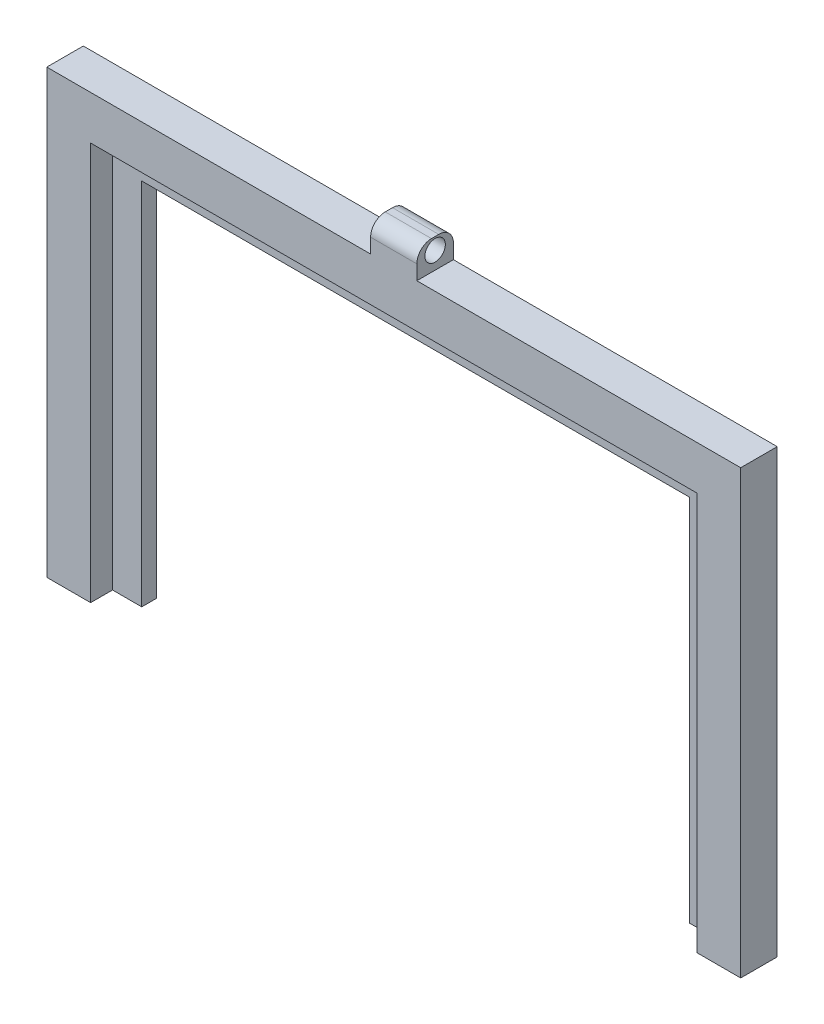
ISO-10303-21;
HEADER;
FILE_DESCRIPTION(('STEP AP214'),'2;1');
FILE_NAME('part.step','',(''),(''),'','','');
FILE_SCHEMA(('AUTOMOTIVE_DESIGN { 1 0 10303 214 1 1 1 1 }'));
ENDSEC;
DATA;
#1=APPLICATION_CONTEXT('core data for automotive mechanical design processes');
#2=APPLICATION_PROTOCOL_DEFINITION('international standard','automotive_design',2000,#1);
#3=PRODUCT_CONTEXT('',#1,'mechanical');
#4=PRODUCT('Part','Part','',(#3));
#5=PRODUCT_RELATED_PRODUCT_CATEGORY('part','',(#4));
#6=PRODUCT_DEFINITION_FORMATION('','',#4);
#7=PRODUCT_DEFINITION_CONTEXT('part definition',#1,'design');
#8=PRODUCT_DEFINITION('design','',#6,#7);
#9=PRODUCT_DEFINITION_SHAPE('','',#8);
#10=(LENGTH_UNIT() NAMED_UNIT(*) SI_UNIT(.MILLI.,.METRE.));
#11=(NAMED_UNIT(*) PLANE_ANGLE_UNIT() SI_UNIT($,.RADIAN.));
#12=(NAMED_UNIT(*) SI_UNIT($,.STERADIAN.) SOLID_ANGLE_UNIT());
#13=UNCERTAINTY_MEASURE_WITH_UNIT(LENGTH_MEASURE(1.E-05),#10,'distance_accuracy_value','');
#14=(GEOMETRIC_REPRESENTATION_CONTEXT(3) GLOBAL_UNCERTAINTY_ASSIGNED_CONTEXT((#13)) GLOBAL_UNIT_ASSIGNED_CONTEXT((#10,
#11,#12)) REPRESENTATION_CONTEXT('',''));
#15=CARTESIAN_POINT('',(0.,0.,0.));
#16=DIRECTION('',(0.,0.,1.));
#17=DIRECTION('',(1.,0.,0.));
#18=AXIS2_PLACEMENT_3D('',#15,#16,#17);
#19=CARTESIAN_POINT('',(40.2901985273528,-92.9612009730958,2.));
#20=DIRECTION('',(1.,0.,0.));
#21=DIRECTION('',(0.,0.,-1.));
#22=AXIS2_PLACEMENT_3D('',#19,#20,#21);
#23=PLANE('',#22);
#24=DIRECTION('',(0.,-1.,0.));
#25=VECTOR('',#24,1.);
#26=CARTESIAN_POINT('',(40.2901985273528,-92.9612009730958,0.));
#27=LINE('',#26,#25);
#28=CARTESIAN_POINT('',(40.2901985273528,15.0348792204431,0.));
#29=VERTEX_POINT('',#28);
#30=CARTESIAN_POINT('',(40.2901985273528,-35.4651207795569,0.));
#31=VERTEX_POINT('',#30);
#32=EDGE_CURVE('E247',#29,#31,#27,.T.);
#33=ORIENTED_EDGE('',*,*,#32,.T.);
#34=DIRECTION('',(0.,0.,-1.));
#35=VECTOR('',#34,1.);
#36=CARTESIAN_POINT('',(40.2901985273528,-35.4651207795569,2.));
#37=LINE('',#36,#35);
#38=CARTESIAN_POINT('',(40.2901985273528,-35.4651207795569,2.));
#39=VERTEX_POINT('',#38);
#40=EDGE_CURVE('E286',#39,#31,#37,.T.);
#41=ORIENTED_EDGE('',*,*,#40,.F.);
#42=DIRECTION('',(0.,-1.,0.));
#43=VECTOR('',#42,1.);
#44=CARTESIAN_POINT('',(40.2901985273528,-92.9612009730958,2.));
#45=LINE('',#44,#43);
#46=CARTESIAN_POINT('',(40.2901985273528,15.0348792204431,2.));
#47=VERTEX_POINT('',#46);
#48=EDGE_CURVE('E248',#47,#39,#45,.T.);
#49=ORIENTED_EDGE('',*,*,#48,.F.);
#50=DIRECTION('',(0.,0.,-1.));
#51=VECTOR('',#50,1.);
#52=CARTESIAN_POINT('',(40.2901985273528,15.0348792204431,2.));
#53=LINE('',#52,#51);
#54=EDGE_CURVE('E268',#47,#29,#53,.T.);
#55=ORIENTED_EDGE('',*,*,#54,.T.);
#56=EDGE_LOOP('',(#33,#41,#49,#55));
#57=FACE_BOUND('',#56,.T.);
#58=ADVANCED_FACE('F35',(#57),#23,.F.);
#59=CARTESIAN_POINT('',(2.79019852735279,-35.4651207795569,2.));
#60=DIRECTION('',(0.,1.,0.));
#61=DIRECTION('',(0.,0.,1.));
#62=AXIS2_PLACEMENT_3D('',#59,#60,#61);
#63=PLANE('',#62);
#64=DIRECTION('',(1.,0.,0.));
#65=VECTOR('',#64,1.);
#66=CARTESIAN_POINT('',(2.79019852735279,-35.4651207795569,0.));
#67=LINE('',#66,#65);
#68=CARTESIAN_POINT('',(50.2901985273528,-35.4651207795569,0.));
#69=VERTEX_POINT('',#68);
#70=EDGE_CURVE('E271',#31,#69,#67,.T.);
#71=ORIENTED_EDGE('',*,*,#70,.T.);
#72=DIRECTION('',(0.,0.,-1.));
#73=VECTOR('',#72,1.);
#74=CARTESIAN_POINT('',(50.2901985273528,-35.4651207795569,5.));
#75=LINE('',#74,#73);
#76=CARTESIAN_POINT('',(50.2901985273528,-35.4651207795569,5.));
#77=VERTEX_POINT('',#76);
#78=EDGE_CURVE('E226',#77,#69,#75,.T.);
#79=ORIENTED_EDGE('',*,*,#78,.F.);
#80=DIRECTION('',(-1.,0.,0.));
#81=VECTOR('',#80,1.);
#82=CARTESIAN_POINT('',(2.79019852735279,-35.4651207795569,5.));
#83=LINE('',#82,#81);
#84=CARTESIAN_POINT('',(44.2901985273528,-35.4651207795569,5.));
#85=VERTEX_POINT('',#84);
#86=EDGE_CURVE('E197',#77,#85,#83,.T.);
#87=ORIENTED_EDGE('',*,*,#86,.T.);
#88=DIRECTION('',(0.,0.,-1.));
#89=VECTOR('',#88,1.);
#90=CARTESIAN_POINT('',(44.2901985273528,-35.4651207795569,5.));
#91=LINE('',#90,#89);
#92=CARTESIAN_POINT('',(44.2901985273528,-35.4651207795569,2.));
#93=VERTEX_POINT('',#92);
#94=EDGE_CURVE('E229',#85,#93,#91,.T.);
#95=ORIENTED_EDGE('',*,*,#94,.T.);
#96=DIRECTION('',(1.,0.,0.));
#97=VECTOR('',#96,1.);
#98=CARTESIAN_POINT('',(2.79019852735279,-35.4651207795569,2.));
#99=LINE('',#98,#97);
#100=EDGE_CURVE('E251',#39,#93,#99,.T.);
#101=ORIENTED_EDGE('',*,*,#100,.F.);
#102=ORIENTED_EDGE('',*,*,#40,.T.);
#103=EDGE_LOOP('',(#71,#79,#87,#95,#101,#102));
#104=FACE_BOUND('',#103,.T.);
#105=ADVANCED_FACE('F338',(#104),#63,.F.);
#106=CARTESIAN_POINT('',(2.79019852735279,-35.4651207795569,2.));
#107=DIRECTION('',(0.,1.,0.));
#108=DIRECTION('',(0.,0.,1.));
#109=AXIS2_PLACEMENT_3D('',#106,#107,#108);
#110=PLANE('',#109);
#111=DIRECTION('',(1.,0.,0.));
#112=VECTOR('',#111,1.);
#113=CARTESIAN_POINT('',(2.79019852735279,-35.4651207795569,0.));
#114=LINE('',#113,#112);
#115=CARTESIAN_POINT('',(-44.7098014726472,-35.4651207795569,0.));
#116=VERTEX_POINT('',#115);
#117=CARTESIAN_POINT('',(-34.7098014726472,-35.4651207795569,0.));
#118=VERTEX_POINT('',#117);
#119=EDGE_CURVE('E273',#116,#118,#114,.T.);
#120=ORIENTED_EDGE('',*,*,#119,.T.);
#121=DIRECTION('',(0.,0.,-1.));
#122=VECTOR('',#121,1.);
#123=CARTESIAN_POINT('',(-34.7098014726472,-35.4651207795569,2.));
#124=LINE('',#123,#122);
#125=CARTESIAN_POINT('',(-34.7098014726472,-35.4651207795569,2.));
#126=VERTEX_POINT('',#125);
#127=EDGE_CURVE('E283',#126,#118,#124,.T.);
#128=ORIENTED_EDGE('',*,*,#127,.F.);
#129=DIRECTION('',(1.,0.,0.));
#130=VECTOR('',#129,1.);
#131=CARTESIAN_POINT('',(2.79019852735279,-35.4651207795569,2.));
#132=LINE('',#131,#130);
#133=CARTESIAN_POINT('',(-38.7098014726472,-35.4651207795569,2.));
#134=VERTEX_POINT('',#133);
#135=EDGE_CURVE('E262',#134,#126,#132,.T.);
#136=ORIENTED_EDGE('',*,*,#135,.F.);
#137=DIRECTION('',(0.,0.,-1.));
#138=VECTOR('',#137,1.);
#139=CARTESIAN_POINT('',(-38.7098014726472,-35.4651207795569,5.));
#140=LINE('',#139,#138);
#141=CARTESIAN_POINT('',(-38.7098014726472,-35.4651207795569,5.));
#142=VERTEX_POINT('',#141);
#143=EDGE_CURVE('E238',#142,#134,#140,.T.);
#144=ORIENTED_EDGE('',*,*,#143,.F.);
#145=DIRECTION('',(-1.,0.,0.));
#146=VECTOR('',#145,1.);
#147=CARTESIAN_POINT('',(2.79019852735279,-35.4651207795569,5.));
#148=LINE('',#147,#146);
#149=CARTESIAN_POINT('',(-44.7098014726472,-35.4651207795569,5.));
#150=VERTEX_POINT('',#149);
#151=EDGE_CURVE('E184',#142,#150,#148,.T.);
#152=ORIENTED_EDGE('',*,*,#151,.T.);
#153=DIRECTION('',(0.,0.,-1.));
#154=VECTOR('',#153,1.);
#155=CARTESIAN_POINT('',(-44.7098014726472,-35.4651207795569,5.));
#156=LINE('',#155,#154);
#157=EDGE_CURVE('E240',#150,#116,#156,.T.);
#158=ORIENTED_EDGE('',*,*,#157,.T.);
#159=EDGE_LOOP('',(#120,#128,#136,#144,#152,#158));
#160=FACE_BOUND('',#159,.T.);
#161=ADVANCED_FACE('F344',(#160),#110,.F.);
#162=CARTESIAN_POINT('',(-34.7098014726472,-92.9612009730958,2.));
#163=DIRECTION('',(-1.,0.,0.));
#164=DIRECTION('',(0.,0.,1.));
#165=AXIS2_PLACEMENT_3D('',#162,#163,#164);
#166=PLANE('',#165);
#167=DIRECTION('',(0.,1.,0.));
#168=VECTOR('',#167,1.);
#169=CARTESIAN_POINT('',(-34.7098014726472,-92.9612009730958,0.));
#170=LINE('',#169,#168);
#171=CARTESIAN_POINT('',(-34.7098014726472,15.0348792204431,0.));
#172=VERTEX_POINT('',#171);
#173=EDGE_CURVE('E275',#118,#172,#170,.T.);
#174=ORIENTED_EDGE('',*,*,#173,.T.);
#175=DIRECTION('',(0.,0.,-1.));
#176=VECTOR('',#175,1.);
#177=CARTESIAN_POINT('',(-34.7098014726472,15.0348792204431,2.));
#178=LINE('',#177,#176);
#179=CARTESIAN_POINT('',(-34.7098014726472,15.0348792204431,2.));
#180=VERTEX_POINT('',#179);
#181=EDGE_CURVE('E280',#180,#172,#178,.T.);
#182=ORIENTED_EDGE('',*,*,#181,.F.);
#183=DIRECTION('',(0.,1.,0.));
#184=VECTOR('',#183,1.);
#185=CARTESIAN_POINT('',(-34.7098014726472,-92.9612009730958,2.));
#186=LINE('',#185,#184);
#187=EDGE_CURVE('E264',#126,#180,#186,.T.);
#188=ORIENTED_EDGE('',*,*,#187,.F.);
#189=ORIENTED_EDGE('',*,*,#127,.T.);
#190=EDGE_LOOP('',(#174,#182,#188,#189));
#191=FACE_BOUND('',#190,.T.);
#192=ADVANCED_FACE('F486',(#191),#166,.F.);
#193=CARTESIAN_POINT('',(2.79019852735279,15.0348792204431,2.));
#194=DIRECTION('',(0.,1.,0.));
#195=DIRECTION('',(0.,0.,1.));
#196=AXIS2_PLACEMENT_3D('',#193,#194,#195);
#197=PLANE('',#196);
#198=DIRECTION('',(1.,0.,0.));
#199=VECTOR('',#198,1.);
#200=CARTESIAN_POINT('',(2.79019852735279,15.0348792204431,0.));
#201=LINE('',#200,#199);
#202=EDGE_CURVE('E252',#172,#29,#201,.T.);
#203=ORIENTED_EDGE('',*,*,#202,.T.);
#204=ORIENTED_EDGE('',*,*,#54,.F.);
#205=DIRECTION('',(1.,0.,0.));
#206=VECTOR('',#205,1.);
#207=CARTESIAN_POINT('',(2.79019852735279,15.0348792204431,2.));
#208=LINE('',#207,#206);
#209=EDGE_CURVE('E266',#180,#47,#208,.T.);
#210=ORIENTED_EDGE('',*,*,#209,.F.);
#211=ORIENTED_EDGE('',*,*,#181,.T.);
#212=EDGE_LOOP('',(#203,#204,#210,#211));
#213=FACE_BOUND('',#212,.T.);
#214=ADVANCED_FACE('F478',(#213),#197,.F.);
#215=CARTESIAN_POINT('',(2.79019852735279,-92.9612009730958,2.));
#216=DIRECTION('',(0.,0.,1.));
#217=DIRECTION('',(1.,0.,0.));
#218=AXIS2_PLACEMENT_3D('',#215,#216,#217);
#219=PLANE('',#218);
#220=ORIENTED_EDGE('',*,*,#48,.T.);
#221=ORIENTED_EDGE('',*,*,#100,.T.);
#222=DIRECTION('',(0.,-1.,0.));
#223=VECTOR('',#222,1.);
#224=CARTESIAN_POINT('',(44.2901985273528,-92.9612009730958,2.));
#225=LINE('',#224,#223);
#226=CARTESIAN_POINT('',(44.2901985273528,19.0348792204431,2.));
#227=VERTEX_POINT('',#226);
#228=EDGE_CURVE('E255',#227,#93,#225,.T.);
#229=ORIENTED_EDGE('',*,*,#228,.F.);
#230=DIRECTION('',(1.,0.,0.));
#231=VECTOR('',#230,1.);
#232=CARTESIAN_POINT('',(2.79019852735279,19.0348792204431,2.));
#233=LINE('',#232,#231);
#234=CARTESIAN_POINT('',(-38.7098014726472,19.0348792204431,2.));
#235=VERTEX_POINT('',#234);
#236=EDGE_CURVE('E257',#235,#227,#233,.T.);
#237=ORIENTED_EDGE('',*,*,#236,.F.);
#238=DIRECTION('',(0.,-1.,0.));
#239=VECTOR('',#238,1.);
#240=CARTESIAN_POINT('',(-38.7098014726472,-92.9612009730958,2.));
#241=LINE('',#240,#239);
#242=EDGE_CURVE('E259',#235,#134,#241,.T.);
#243=ORIENTED_EDGE('',*,*,#242,.T.);
#244=ORIENTED_EDGE('',*,*,#135,.T.);
#245=ORIENTED_EDGE('',*,*,#187,.T.);
#246=ORIENTED_EDGE('',*,*,#209,.T.);
#247=EDGE_LOOP('',(#220,#221,#229,#237,#243,#244,#245,#246));
#248=FACE_BOUND('',#247,.T.);
#249=ADVANCED_FACE('F334',(#248),#219,.T.);
#250=CARTESIAN_POINT('',(2.79019852735279,-92.9612009730958,0.));
#251=DIRECTION('',(0.,0.,1.));
#252=DIRECTION('',(1.,0.,0.));
#253=AXIS2_PLACEMENT_3D('',#250,#251,#252);
#254=PLANE('',#253);
#255=DIRECTION('',(0.,-1.,0.));
#256=VECTOR('',#255,1.);
#257=CARTESIAN_POINT('',(-0.374801472647244,-92.9612009730958,0.));
#258=LINE('',#257,#256);
#259=CARTESIAN_POINT('',(-0.374801472647218,27.0348792204431,0.));
#260=VERTEX_POINT('',#259);
#261=CARTESIAN_POINT('',(-0.374801472647219,25.0348792204431,0.));
#262=VERTEX_POINT('',#261);
#263=EDGE_CURVE('E174',#260,#262,#258,.T.);
#264=ORIENTED_EDGE('',*,*,#263,.F.);
#265=DIRECTION('',(1.,0.,0.));
#266=VECTOR('',#265,1.);
#267=CARTESIAN_POINT('',(5.95519852735278,27.0348792204431,0.));
#268=LINE('',#267,#266);
#269=CARTESIAN_POINT('',(5.95519852735278,27.0348792204431,0.));
#270=VERTEX_POINT('',#269);
#271=EDGE_CURVE('E289',#260,#270,#268,.T.);
#272=ORIENTED_EDGE('',*,*,#271,.T.);
#273=DIRECTION('',(0.,-1.,0.));
#274=VECTOR('',#273,1.);
#275=CARTESIAN_POINT('',(5.95519852735281,-92.9612009730958,0.));
#276=LINE('',#275,#274);
#277=CARTESIAN_POINT('',(5.95519852735278,25.0348792204431,0.));
#278=VERTEX_POINT('',#277);
#279=EDGE_CURVE('E207',#270,#278,#276,.T.);
#280=ORIENTED_EDGE('',*,*,#279,.T.);
#281=DIRECTION('',(1.,0.,0.));
#282=VECTOR('',#281,1.);
#283=CARTESIAN_POINT('',(2.79019852735281,25.0348792204431,0.));
#284=LINE('',#283,#282);
#285=CARTESIAN_POINT('',(50.2901985273528,25.0348792204431,0.));
#286=VERTEX_POINT('',#285);
#287=EDGE_CURVE('E219',#278,#286,#284,.T.);
#288=ORIENTED_EDGE('',*,*,#287,.T.);
#289=DIRECTION('',(0.,-1.,0.));
#290=VECTOR('',#289,1.);
#291=CARTESIAN_POINT('',(50.2901985273528,-92.9612009730958,0.));
#292=LINE('',#291,#290);
#293=EDGE_CURVE('E216',#286,#69,#292,.T.);
#294=ORIENTED_EDGE('',*,*,#293,.T.);
#295=ORIENTED_EDGE('',*,*,#70,.F.);
#296=ORIENTED_EDGE('',*,*,#32,.F.);
#297=ORIENTED_EDGE('',*,*,#202,.F.);
#298=ORIENTED_EDGE('',*,*,#173,.F.);
#299=ORIENTED_EDGE('',*,*,#119,.F.);
#300=DIRECTION('',(0.,1.,0.));
#301=VECTOR('',#300,1.);
#302=CARTESIAN_POINT('',(-44.7098014726472,-92.9612009730958,0.));
#303=LINE('',#302,#301);
#304=CARTESIAN_POINT('',(-44.7098014726472,25.0348792204431,0.));
#305=VERTEX_POINT('',#304);
#306=EDGE_CURVE('E213',#116,#305,#303,.T.);
#307=ORIENTED_EDGE('',*,*,#306,.T.);
#308=DIRECTION('',(1.,0.,0.));
#309=VECTOR('',#308,1.);
#310=CARTESIAN_POINT('',(2.79019852735277,25.0348792204431,0.));
#311=LINE('',#310,#309);
#312=EDGE_CURVE('E211',#305,#262,#311,.T.);
#313=ORIENTED_EDGE('',*,*,#312,.T.);
#314=EDGE_LOOP('',(#264,#272,#280,#288,#294,#295,#296,#297,#298,#299,#307,#313));
#315=FACE_BOUND('',#314,.T.);
#316=ADVANCED_FACE('F308',(#315),#254,.F.);
#317=CARTESIAN_POINT('',(5.95519852735281,-92.9612009730958,5.));
#318=DIRECTION('',(1.,0.,0.));
#319=DIRECTION('',(0.,1.,0.));
#320=AXIS2_PLACEMENT_3D('',#317,#318,#319);
#321=PLANE('',#320);
#322=CARTESIAN_POINT('',(5.95519852735278,27.3948792204431,2.5));
#323=DIRECTION('',(1.,0.,0.));
#324=DIRECTION('',(0.,1.,0.));
#325=AXIS2_PLACEMENT_3D('',#322,#323,#324);
#326=CIRCLE('',#325,1.4);
#327=CARTESIAN_POINT('',(5.95519852735278,28.7948792204431,2.5));
#328=VERTEX_POINT('',#327);
#329=EDGE_CURVE('E292',#328,#328,#326,.T.);
#330=ORIENTED_EDGE('',*,*,#329,.F.);
#331=EDGE_LOOP('',(#330));
#332=FACE_BOUND('',#331,.T.);
#333=ORIENTED_EDGE('',*,*,#279,.F.);
#334=CARTESIAN_POINT('',(5.95519852735278,27.0348792204431,2.));
#335=DIRECTION('',(1.,0.,0.));
#336=DIRECTION('',(0.,1.,0.));
#337=AXIS2_PLACEMENT_3D('',#334,#335,#336);
#338=CIRCLE('',#337,2.);
#339=CARTESIAN_POINT('',(5.95519852735278,29.0348792204431,2.));
#340=VERTEX_POINT('',#339);
#341=EDGE_CURVE('E297',#270,#340,#338,.T.);
#342=ORIENTED_EDGE('',*,*,#341,.T.);
#343=DIRECTION('',(0.,0.,-1.));
#344=VECTOR('',#343,1.);
#345=CARTESIAN_POINT('',(5.95519852735278,29.0348792204431,5.));
#346=LINE('',#345,#344);
#347=CARTESIAN_POINT('',(5.95519852735278,29.0348792204431,3.));
#348=VERTEX_POINT('',#347);
#349=EDGE_CURVE('E245',#348,#340,#346,.T.);
#350=ORIENTED_EDGE('',*,*,#349,.F.);
#351=CARTESIAN_POINT('',(5.95519852735278,27.0348792204431,3.));
#352=DIRECTION('',(1.,0.,0.));
#353=DIRECTION('',(0.,1.,0.));
#354=AXIS2_PLACEMENT_3D('',#351,#352,#353);
#355=CIRCLE('',#354,2.);
#356=CARTESIAN_POINT('',(5.95519852735278,27.0348792204431,5.));
#357=VERTEX_POINT('',#356);
#358=EDGE_CURVE('E295',#348,#357,#355,.T.);
#359=ORIENTED_EDGE('',*,*,#358,.T.);
#360=DIRECTION('',(0.,-1.,0.));
#361=VECTOR('',#360,1.);
#362=CARTESIAN_POINT('',(5.95519852735281,-92.9612009730958,5.));
#363=LINE('',#362,#361);
#364=CARTESIAN_POINT('',(5.95519852735278,25.0348792204431,5.));
#365=VERTEX_POINT('',#364);
#366=EDGE_CURVE('E168',#357,#365,#363,.T.);
#367=ORIENTED_EDGE('',*,*,#366,.T.);
#368=DIRECTION('',(0.,0.,-1.));
#369=VECTOR('',#368,1.);
#370=CARTESIAN_POINT('',(5.95519852735278,25.0348792204431,5.));
#371=LINE('',#370,#369);
#372=EDGE_CURVE('E206',#365,#278,#371,.T.);
#373=ORIENTED_EDGE('',*,*,#372,.T.);
#374=EDGE_LOOP('',(#333,#342,#350,#359,#367,#373));
#375=FACE_BOUND('',#374,.T.);
#376=ADVANCED_FACE('F313',(#332,#375),#321,.T.);
#377=CARTESIAN_POINT('',(2.79019852735279,29.0348792204431,5.));
#378=DIRECTION('',(0.,1.,0.));
#379=DIRECTION('',(0.,0.,1.));
#380=AXIS2_PLACEMENT_3D('',#377,#378,#379);
#381=PLANE('',#380);
#382=ORIENTED_EDGE('',*,*,#349,.T.);
#383=DIRECTION('',(1.,0.,0.));
#384=VECTOR('',#383,1.);
#385=CARTESIAN_POINT('',(-0.374801472647218,29.0348792204431,2.));
#386=LINE('',#385,#384);
#387=CARTESIAN_POINT('',(-0.374801472647218,29.0348792204431,2.));
#388=VERTEX_POINT('',#387);
#389=EDGE_CURVE('E56',#340,#388,#386,.F.);
#390=ORIENTED_EDGE('',*,*,#389,.T.);
#391=DIRECTION('',(0.,0.,-1.));
#392=VECTOR('',#391,1.);
#393=CARTESIAN_POINT('',(-0.374801472647218,29.0348792204431,5.));
#394=LINE('',#393,#392);
#395=CARTESIAN_POINT('',(-0.374801472647218,29.0348792204431,3.));
#396=VERTEX_POINT('',#395);
#397=EDGE_CURVE('E178',#396,#388,#394,.T.);
#398=ORIENTED_EDGE('',*,*,#397,.F.);
#399=DIRECTION('',(1.,0.,0.));
#400=VECTOR('',#399,1.);
#401=CARTESIAN_POINT('',(2.79019852735279,29.0348792204431,3.));
#402=LINE('',#401,#400);
#403=EDGE_CURVE('E299',#396,#348,#402,.T.);
#404=ORIENTED_EDGE('',*,*,#403,.T.);
#405=EDGE_LOOP('',(#382,#390,#398,#404));
#406=FACE_BOUND('',#405,.T.);
#407=ADVANCED_FACE('F314',(#406),#381,.T.);
#408=CARTESIAN_POINT('',(-0.374801472647244,-92.9612009730958,5.));
#409=DIRECTION('',(1.,0.,0.));
#410=DIRECTION('',(0.,1.,0.));
#411=AXIS2_PLACEMENT_3D('',#408,#409,#410);
#412=PLANE('',#411);
#413=CARTESIAN_POINT('',(-0.374801472647218,27.3948792204431,2.5));
#414=DIRECTION('',(1.,0.,0.));
#415=DIRECTION('',(0.,1.,0.));
#416=AXIS2_PLACEMENT_3D('',#413,#414,#415);
#417=CIRCLE('',#416,1.4);
#418=CARTESIAN_POINT('',(-0.374801472647218,28.7948792204431,2.5));
#419=VERTEX_POINT('',#418);
#420=EDGE_CURVE('E209',#419,#419,#417,.T.);
#421=ORIENTED_EDGE('',*,*,#420,.T.);
#422=EDGE_LOOP('',(#421));
#423=FACE_BOUND('',#422,.T.);
#424=ORIENTED_EDGE('',*,*,#397,.T.);
#425=CARTESIAN_POINT('',(-0.374801472647218,27.0348792204431,2.));
#426=DIRECTION('',(1.,0.,0.));
#427=DIRECTION('',(0.,1.,0.));
#428=AXIS2_PLACEMENT_3D('',#425,#426,#427);
#429=CIRCLE('',#428,2.);
#430=EDGE_CURVE('E43',#388,#260,#429,.F.);
#431=ORIENTED_EDGE('',*,*,#430,.T.);
#432=ORIENTED_EDGE('',*,*,#263,.T.);
#433=DIRECTION('',(0.,0.,-1.));
#434=VECTOR('',#433,1.);
#435=CARTESIAN_POINT('',(-0.374801472647219,25.0348792204431,5.));
#436=LINE('',#435,#434);
#437=CARTESIAN_POINT('',(-0.374801472647219,25.0348792204431,5.));
#438=VERTEX_POINT('',#437);
#439=EDGE_CURVE('E171',#438,#262,#436,.T.);
#440=ORIENTED_EDGE('',*,*,#439,.F.);
#441=DIRECTION('',(0.,-1.,0.));
#442=VECTOR('',#441,1.);
#443=CARTESIAN_POINT('',(-0.374801472647244,-92.9612009730958,5.));
#444=LINE('',#443,#442);
#445=CARTESIAN_POINT('',(-0.374801472647218,27.0348792204431,5.));
#446=VERTEX_POINT('',#445);
#447=EDGE_CURVE('E159',#446,#438,#444,.T.);
#448=ORIENTED_EDGE('',*,*,#447,.F.);
#449=CARTESIAN_POINT('',(-0.374801472647218,27.0348792204431,3.));
#450=DIRECTION('',(1.,0.,0.));
#451=DIRECTION('',(0.,1.,0.));
#452=AXIS2_PLACEMENT_3D('',#449,#450,#451);
#453=CIRCLE('',#452,2.);
#454=EDGE_CURVE('E303',#446,#396,#453,.F.);
#455=ORIENTED_EDGE('',*,*,#454,.T.);
#456=EDGE_LOOP('',(#424,#431,#432,#440,#448,#455));
#457=FACE_BOUND('',#456,.T.);
#458=ADVANCED_FACE('F172',(#423,#457),#412,.F.);
#459=CARTESIAN_POINT('',(2.79019852735277,25.0348792204431,5.));
#460=DIRECTION('',(0.,1.,0.));
#461=DIRECTION('',(-1.,0.,0.));
#462=AXIS2_PLACEMENT_3D('',#459,#460,#461);
#463=PLANE('',#462);
#464=ORIENTED_EDGE('',*,*,#312,.F.);
#465=DIRECTION('',(0.,0.,-1.));
#466=VECTOR('',#465,1.);
#467=CARTESIAN_POINT('',(-44.7098014726472,25.0348792204431,5.));
#468=LINE('',#467,#466);
#469=CARTESIAN_POINT('',(-44.7098014726472,25.0348792204431,5.));
#470=VERTEX_POINT('',#469);
#471=EDGE_CURVE('E179',#470,#305,#468,.T.);
#472=ORIENTED_EDGE('',*,*,#471,.F.);
#473=DIRECTION('',(1.,0.,0.));
#474=VECTOR('',#473,1.);
#475=CARTESIAN_POINT('',(2.79019852735277,25.0348792204431,5.));
#476=LINE('',#475,#474);
#477=EDGE_CURVE('E164',#470,#438,#476,.T.);
#478=ORIENTED_EDGE('',*,*,#477,.T.);
#479=ORIENTED_EDGE('',*,*,#439,.T.);
#480=EDGE_LOOP('',(#464,#472,#478,#479));
#481=FACE_BOUND('',#480,.T.);
#482=ADVANCED_FACE('F181',(#481),#463,.T.);
#483=CARTESIAN_POINT('',(-44.7098014726472,-92.9612009730958,5.));
#484=DIRECTION('',(-1.,0.,0.));
#485=DIRECTION('',(0.,0.,1.));
#486=AXIS2_PLACEMENT_3D('',#483,#484,#485);
#487=PLANE('',#486);
#488=ORIENTED_EDGE('',*,*,#306,.F.);
#489=ORIENTED_EDGE('',*,*,#157,.F.);
#490=DIRECTION('',(0.,1.,0.));
#491=VECTOR('',#490,1.);
#492=CARTESIAN_POINT('',(-44.7098014726472,-92.9612009730958,5.));
#493=LINE('',#492,#491);
#494=EDGE_CURVE('E182',#150,#470,#493,.T.);
#495=ORIENTED_EDGE('',*,*,#494,.T.);
#496=ORIENTED_EDGE('',*,*,#471,.T.);
#497=EDGE_LOOP('',(#488,#489,#495,#496));
#498=FACE_BOUND('',#497,.T.);
#499=ADVANCED_FACE('F378',(#498),#487,.T.);
#500=CARTESIAN_POINT('',(-38.7098014726472,-92.9612009730958,5.));
#501=DIRECTION('',(1.,0.,0.));
#502=DIRECTION('',(0.,1.,0.));
#503=AXIS2_PLACEMENT_3D('',#500,#501,#502);
#504=PLANE('',#503);
#505=ORIENTED_EDGE('',*,*,#143,.T.);
#506=ORIENTED_EDGE('',*,*,#242,.F.);
#507=DIRECTION('',(0.,0.,-1.));
#508=VECTOR('',#507,1.);
#509=CARTESIAN_POINT('',(-38.7098014726472,19.0348792204431,5.));
#510=LINE('',#509,#508);
#511=CARTESIAN_POINT('',(-38.7098014726472,19.0348792204431,5.));
#512=VERTEX_POINT('',#511);
#513=EDGE_CURVE('E235',#512,#235,#510,.T.);
#514=ORIENTED_EDGE('',*,*,#513,.F.);
#515=DIRECTION('',(0.,-1.,0.));
#516=VECTOR('',#515,1.);
#517=CARTESIAN_POINT('',(-38.7098014726472,-92.9612009730958,5.));
#518=LINE('',#517,#516);
#519=EDGE_CURVE('E190',#512,#142,#518,.T.);
#520=ORIENTED_EDGE('',*,*,#519,.T.);
#521=EDGE_LOOP('',(#505,#506,#514,#520));
#522=FACE_BOUND('',#521,.T.);
#523=ADVANCED_FACE('F374',(#522),#504,.T.);
#524=CARTESIAN_POINT('',(2.79019852735279,19.0348792204431,5.));
#525=DIRECTION('',(0.,1.,0.));
#526=DIRECTION('',(0.,0.,1.));
#527=AXIS2_PLACEMENT_3D('',#524,#525,#526);
#528=PLANE('',#527);
#529=ORIENTED_EDGE('',*,*,#236,.T.);
#530=DIRECTION('',(0.,0.,-1.));
#531=VECTOR('',#530,1.);
#532=CARTESIAN_POINT('',(44.2901985273528,19.0348792204431,5.));
#533=LINE('',#532,#531);
#534=CARTESIAN_POINT('',(44.2901985273528,19.0348792204431,5.));
#535=VERTEX_POINT('',#534);
#536=EDGE_CURVE('E232',#535,#227,#533,.T.);
#537=ORIENTED_EDGE('',*,*,#536,.F.);
#538=DIRECTION('',(1.,0.,0.));
#539=VECTOR('',#538,1.);
#540=CARTESIAN_POINT('',(2.79019852735279,19.0348792204431,5.));
#541=LINE('',#540,#539);
#542=EDGE_CURVE('E193',#512,#535,#541,.T.);
#543=ORIENTED_EDGE('',*,*,#542,.F.);
#544=ORIENTED_EDGE('',*,*,#513,.T.);
#545=EDGE_LOOP('',(#529,#537,#543,#544));
#546=FACE_BOUND('',#545,.T.);
#547=ADVANCED_FACE('F370',(#546),#528,.F.);
#548=CARTESIAN_POINT('',(44.2901985273528,-92.9612009730958,5.));
#549=DIRECTION('',(1.,0.,0.));
#550=DIRECTION('',(0.,1.,0.));
#551=AXIS2_PLACEMENT_3D('',#548,#549,#550);
#552=PLANE('',#551);
#553=ORIENTED_EDGE('',*,*,#228,.T.);
#554=ORIENTED_EDGE('',*,*,#94,.F.);
#555=DIRECTION('',(0.,-1.,0.));
#556=VECTOR('',#555,1.);
#557=CARTESIAN_POINT('',(44.2901985273528,-92.9612009730958,5.));
#558=LINE('',#557,#556);
#559=EDGE_CURVE('E195',#535,#85,#558,.T.);
#560=ORIENTED_EDGE('',*,*,#559,.F.);
#561=ORIENTED_EDGE('',*,*,#536,.T.);
#562=EDGE_LOOP('',(#553,#554,#560,#561));
#563=FACE_BOUND('',#562,.T.);
#564=ADVANCED_FACE('F366',(#563),#552,.F.);
#565=CARTESIAN_POINT('',(50.2901985273528,-92.9612009730958,5.));
#566=DIRECTION('',(1.,0.,0.));
#567=DIRECTION('',(0.,1.,0.));
#568=AXIS2_PLACEMENT_3D('',#565,#566,#567);
#569=PLANE('',#568);
#570=ORIENTED_EDGE('',*,*,#293,.F.);
#571=DIRECTION('',(0.,0.,-1.));
#572=VECTOR('',#571,1.);
#573=CARTESIAN_POINT('',(50.2901985273528,25.0348792204431,5.));
#574=LINE('',#573,#572);
#575=CARTESIAN_POINT('',(50.2901985273528,25.0348792204431,5.));
#576=VERTEX_POINT('',#575);
#577=EDGE_CURVE('E224',#576,#286,#574,.T.);
#578=ORIENTED_EDGE('',*,*,#577,.F.);
#579=DIRECTION('',(0.,-1.,0.));
#580=VECTOR('',#579,1.);
#581=CARTESIAN_POINT('',(50.2901985273528,-92.9612009730958,5.));
#582=LINE('',#581,#580);
#583=EDGE_CURVE('E200',#576,#77,#582,.T.);
#584=ORIENTED_EDGE('',*,*,#583,.T.);
#585=ORIENTED_EDGE('',*,*,#78,.T.);
#586=EDGE_LOOP('',(#570,#578,#584,#585));
#587=FACE_BOUND('',#586,.T.);
#588=ADVANCED_FACE('F362',(#587),#569,.T.);
#589=CARTESIAN_POINT('',(2.79019852735281,25.0348792204431,5.));
#590=DIRECTION('',(0.,1.,0.));
#591=DIRECTION('',(-1.,0.,0.));
#592=AXIS2_PLACEMENT_3D('',#589,#590,#591);
#593=PLANE('',#592);
#594=ORIENTED_EDGE('',*,*,#287,.F.);
#595=ORIENTED_EDGE('',*,*,#372,.F.);
#596=DIRECTION('',(1.,0.,0.));
#597=VECTOR('',#596,1.);
#598=CARTESIAN_POINT('',(2.79019852735281,25.0348792204431,5.));
#599=LINE('',#598,#597);
#600=EDGE_CURVE('E203',#365,#576,#599,.T.);
#601=ORIENTED_EDGE('',*,*,#600,.T.);
#602=ORIENTED_EDGE('',*,*,#577,.T.);
#603=EDGE_LOOP('',(#594,#595,#601,#602));
#604=FACE_BOUND('',#603,.T.);
#605=ADVANCED_FACE('F357',(#604),#593,.T.);
#606=CARTESIAN_POINT('',(2.79019852735279,-92.9612009730958,5.));
#607=DIRECTION('',(0.,0.,1.));
#608=DIRECTION('',(1.,0.,0.));
#609=AXIS2_PLACEMENT_3D('',#606,#607,#608);
#610=PLANE('',#609);
#611=ORIENTED_EDGE('',*,*,#366,.F.);
#612=DIRECTION('',(1.,0.,0.));
#613=VECTOR('',#612,1.);
#614=CARTESIAN_POINT('',(2.79019852735279,27.0348792204431,5.));
#615=LINE('',#614,#613);
#616=EDGE_CURVE('E11',#357,#446,#615,.F.);
#617=ORIENTED_EDGE('',*,*,#616,.T.);
#618=ORIENTED_EDGE('',*,*,#447,.T.);
#619=ORIENTED_EDGE('',*,*,#477,.F.);
#620=ORIENTED_EDGE('',*,*,#494,.F.);
#621=ORIENTED_EDGE('',*,*,#151,.F.);
#622=ORIENTED_EDGE('',*,*,#519,.F.);
#623=ORIENTED_EDGE('',*,*,#542,.T.);
#624=ORIENTED_EDGE('',*,*,#559,.T.);
#625=ORIENTED_EDGE('',*,*,#86,.F.);
#626=ORIENTED_EDGE('',*,*,#583,.F.);
#627=ORIENTED_EDGE('',*,*,#600,.F.);
#628=EDGE_LOOP('',(#611,#617,#618,#619,#620,#621,#622,#623,#624,#625,#626,#627));
#629=FACE_BOUND('',#628,.T.);
#630=ADVANCED_FACE('F161',(#629),#610,.T.);
#631=CARTESIAN_POINT('',(-2.04480147264722,27.3948792204431,2.5));
#632=DIRECTION('',(1.,0.,0.));
#633=DIRECTION('',(0.,1.,0.));
#634=AXIS2_PLACEMENT_3D('',#631,#632,#633);
#635=CYLINDRICAL_SURFACE('',#634,1.4);
#636=ORIENTED_EDGE('',*,*,#329,.T.);
#637=EDGE_LOOP('',(#636));
#638=FACE_BOUND('',#637,.T.);
#639=ORIENTED_EDGE('',*,*,#420,.F.);
#640=EDGE_LOOP('',(#639));
#641=FACE_BOUND('',#640,.T.);
#642=ADVANCED_FACE('F324',(#638,#641),#635,.F.);
#643=CARTESIAN_POINT('',(2.79019852735279,27.0348792204431,2.));
#644=DIRECTION('',(-1.,0.,0.));
#645=DIRECTION('',(0.,0.,1.));
#646=AXIS2_PLACEMENT_3D('',#643,#644,#645);
#647=CYLINDRICAL_SURFACE('',#646,2.);
#648=ORIENTED_EDGE('',*,*,#430,.F.);
#649=ORIENTED_EDGE('',*,*,#389,.F.);
#650=ORIENTED_EDGE('',*,*,#341,.F.);
#651=ORIENTED_EDGE('',*,*,#271,.F.);
#652=EDGE_LOOP('',(#648,#649,#650,#651));
#653=FACE_BOUND('',#652,.T.);
#654=ADVANCED_FACE('F310',(#653),#647,.T.);
#655=CARTESIAN_POINT('',(2.79019852735279,27.0348792204431,3.));
#656=DIRECTION('',(1.,0.,0.));
#657=DIRECTION('',(0.,0.,-1.));
#658=AXIS2_PLACEMENT_3D('',#655,#656,#657);
#659=CYLINDRICAL_SURFACE('',#658,2.);
#660=ORIENTED_EDGE('',*,*,#454,.F.);
#661=ORIENTED_EDGE('',*,*,#616,.F.);
#662=ORIENTED_EDGE('',*,*,#358,.F.);
#663=ORIENTED_EDGE('',*,*,#403,.F.);
#664=EDGE_LOOP('',(#660,#661,#662,#663));
#665=FACE_BOUND('',#664,.T.);
#666=ADVANCED_FACE('F37',(#665),#659,.T.);
#667=CLOSED_SHELL('',(#58,#105,#161,#192,#214,#249,#316,#376,#407,#458,#482,#499,#523,#547,#564,
#588,#605,#630,#642,#654,#666));
#668=MANIFOLD_SOLID_BREP('B2',#667);
#669=ADVANCED_BREP_SHAPE_REPRESENTATION('',(#18,#668),#14);
#670=SHAPE_DEFINITION_REPRESENTATION(#9,#669);
ENDSEC;
END-ISO-10303-21;
